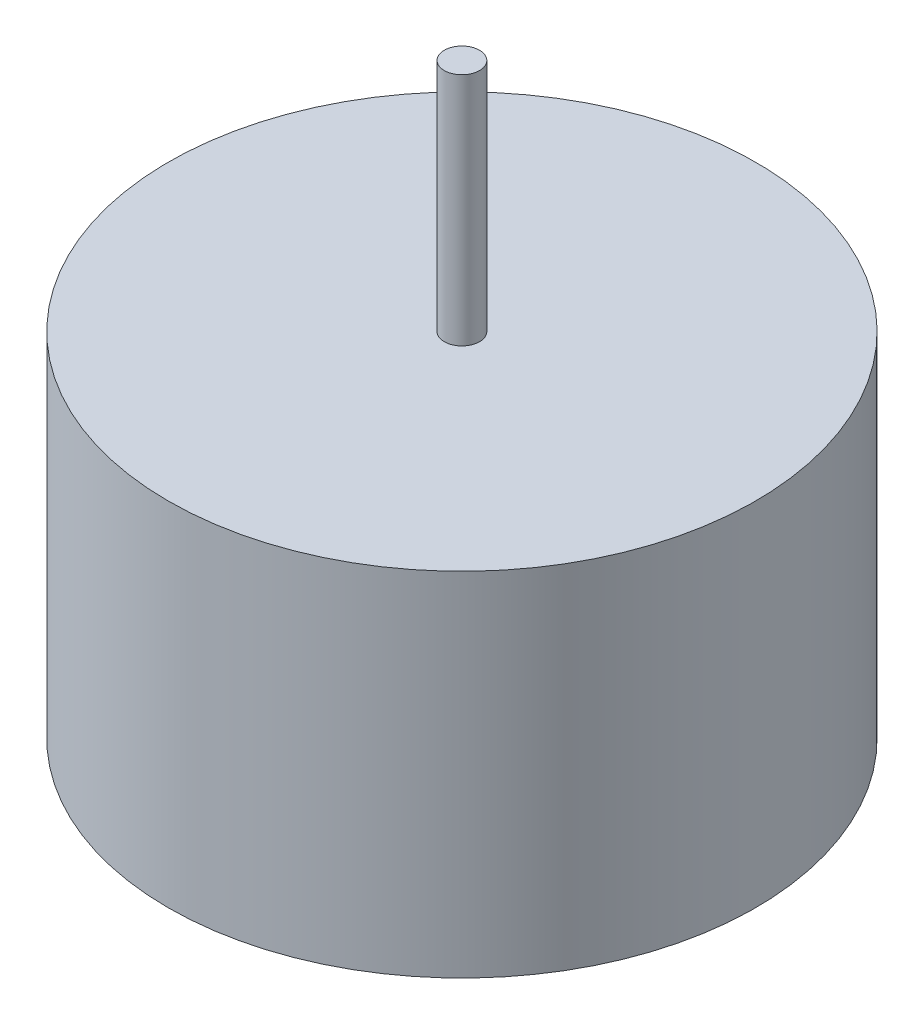
ISO-10303-21;
HEADER;
FILE_DESCRIPTION(('STEP AP214'),'2;1');
FILE_NAME('part.step','',(''),(''),'','','');
FILE_SCHEMA(('AUTOMOTIVE_DESIGN { 1 0 10303 214 1 1 1 1 }'));
ENDSEC;
DATA;
#1=APPLICATION_CONTEXT('core data for automotive mechanical design processes');
#2=APPLICATION_PROTOCOL_DEFINITION('international standard','automotive_design',2000,#1);
#3=PRODUCT_CONTEXT('',#1,'mechanical');
#4=PRODUCT('Part','Part','',(#3));
#5=PRODUCT_RELATED_PRODUCT_CATEGORY('part','',(#4));
#6=PRODUCT_DEFINITION_FORMATION('','',#4);
#7=PRODUCT_DEFINITION_CONTEXT('part definition',#1,'design');
#8=PRODUCT_DEFINITION('design','',#6,#7);
#9=PRODUCT_DEFINITION_SHAPE('','',#8);
#10=(LENGTH_UNIT() NAMED_UNIT(*) SI_UNIT(.MILLI.,.METRE.));
#11=(NAMED_UNIT(*) PLANE_ANGLE_UNIT() SI_UNIT($,.RADIAN.));
#12=(NAMED_UNIT(*) SI_UNIT($,.STERADIAN.) SOLID_ANGLE_UNIT());
#13=UNCERTAINTY_MEASURE_WITH_UNIT(LENGTH_MEASURE(1.E-05),#10,'distance_accuracy_value','');
#14=(GEOMETRIC_REPRESENTATION_CONTEXT(3) GLOBAL_UNCERTAINTY_ASSIGNED_CONTEXT((#13)) GLOBAL_UNIT_ASSIGNED_CONTEXT((#10,
#11,#12)) REPRESENTATION_CONTEXT('',''));
#15=CARTESIAN_POINT('',(0.,0.,0.));
#16=DIRECTION('',(0.,0.,1.));
#17=DIRECTION('',(1.,0.,0.));
#18=AXIS2_PLACEMENT_3D('',#15,#16,#17);
#19=CARTESIAN_POINT('',(0.,30.,0.));
#20=DIRECTION('',(0.,-1.,0.));
#21=DIRECTION('',(0.,0.,-1.));
#22=AXIS2_PLACEMENT_3D('',#19,#20,#21);
#23=CYLINDRICAL_SURFACE('',#22,25.);
#24=CARTESIAN_POINT('',(0.,30.,0.));
#25=DIRECTION('',(0.,1.,0.));
#26=DIRECTION('',(0.,0.,1.));
#27=AXIS2_PLACEMENT_3D('',#24,#25,#26);
#28=CIRCLE('',#27,25.);
#29=CARTESIAN_POINT('',(0.,30.,25.));
#30=VERTEX_POINT('',#29);
#31=EDGE_CURVE('E10',#30,#30,#28,.T.);
#32=ORIENTED_EDGE('',*,*,#31,.F.);
#33=EDGE_LOOP('',(#32));
#34=FACE_BOUND('',#33,.T.);
#35=CARTESIAN_POINT('',(0.,0.,0.));
#36=DIRECTION('',(0.,1.,0.));
#37=DIRECTION('',(0.,0.,1.));
#38=AXIS2_PLACEMENT_3D('',#35,#36,#37);
#39=CIRCLE('',#38,25.);
#40=CARTESIAN_POINT('',(0.,0.,25.));
#41=VERTEX_POINT('',#40);
#42=EDGE_CURVE('E34',#41,#41,#39,.T.);
#43=ORIENTED_EDGE('',*,*,#42,.T.);
#44=EDGE_LOOP('',(#43));
#45=FACE_BOUND('',#44,.T.);
#46=ADVANCED_FACE('F31',(#34,#45),#23,.T.);
#47=CARTESIAN_POINT('',(0.,30.,0.));
#48=DIRECTION('',(0.,1.,0.));
#49=DIRECTION('',(0.,0.,1.));
#50=AXIS2_PLACEMENT_3D('',#47,#48,#49);
#51=PLANE('',#50);
#52=CARTESIAN_POINT('',(0.,30.,0.));
#53=DIRECTION('',(0.,1.,0.));
#54=DIRECTION('',(0.,0.,1.));
#55=AXIS2_PLACEMENT_3D('',#52,#53,#54);
#56=CIRCLE('',#55,1.5);
#57=CARTESIAN_POINT('',(0.,30.,1.5));
#58=VERTEX_POINT('',#57);
#59=EDGE_CURVE('E43',#58,#58,#56,.T.);
#60=ORIENTED_EDGE('',*,*,#59,.F.);
#61=EDGE_LOOP('',(#60));
#62=FACE_BOUND('',#61,.T.);
#63=ORIENTED_EDGE('',*,*,#31,.T.);
#64=EDGE_LOOP('',(#63));
#65=FACE_BOUND('',#64,.T.);
#66=ADVANCED_FACE('F58',(#62,#65),#51,.T.);
#67=CARTESIAN_POINT('',(0.,0.,0.));
#68=DIRECTION('',(0.,1.,0.));
#69=DIRECTION('',(0.,0.,1.));
#70=AXIS2_PLACEMENT_3D('',#67,#68,#69);
#71=PLANE('',#70);
#72=ORIENTED_EDGE('',*,*,#42,.F.);
#73=EDGE_LOOP('',(#72));
#74=FACE_BOUND('',#73,.T.);
#75=ADVANCED_FACE('F54',(#74),#71,.F.);
#76=CARTESIAN_POINT('',(0.,50.,0.));
#77=DIRECTION('',(0.,-1.,0.));
#78=DIRECTION('',(0.,0.,-1.));
#79=AXIS2_PLACEMENT_3D('',#76,#77,#78);
#80=CYLINDRICAL_SURFACE('',#79,1.5);
#81=CARTESIAN_POINT('',(0.,50.,0.));
#82=DIRECTION('',(0.,1.,0.));
#83=DIRECTION('',(0.,0.,1.));
#84=AXIS2_PLACEMENT_3D('',#81,#82,#83);
#85=CIRCLE('',#84,1.5);
#86=CARTESIAN_POINT('',(0.,50.,1.5));
#87=VERTEX_POINT('',#86);
#88=EDGE_CURVE('E41',#87,#87,#85,.T.);
#89=ORIENTED_EDGE('',*,*,#88,.F.);
#90=EDGE_LOOP('',(#89));
#91=FACE_BOUND('',#90,.T.);
#92=ORIENTED_EDGE('',*,*,#59,.T.);
#93=EDGE_LOOP('',(#92));
#94=FACE_BOUND('',#93,.T.);
#95=ADVANCED_FACE('F51',(#91,#94),#80,.T.);
#96=CARTESIAN_POINT('',(0.,50.,0.));
#97=DIRECTION('',(0.,1.,0.));
#98=DIRECTION('',(0.,0.,1.));
#99=AXIS2_PLACEMENT_3D('',#96,#97,#98);
#100=PLANE('',#99);
#101=ORIENTED_EDGE('',*,*,#88,.T.);
#102=EDGE_LOOP('',(#101));
#103=FACE_BOUND('',#102,.T.);
#104=ADVANCED_FACE('F49',(#103),#100,.T.);
#105=CLOSED_SHELL('',(#46,#66,#75,#95,#104));
#106=MANIFOLD_SOLID_BREP('B2',#105);
#107=ADVANCED_BREP_SHAPE_REPRESENTATION('',(#18,#106),#14);
#108=SHAPE_DEFINITION_REPRESENTATION(#9,#107);
ENDSEC;
END-ISO-10303-21;
